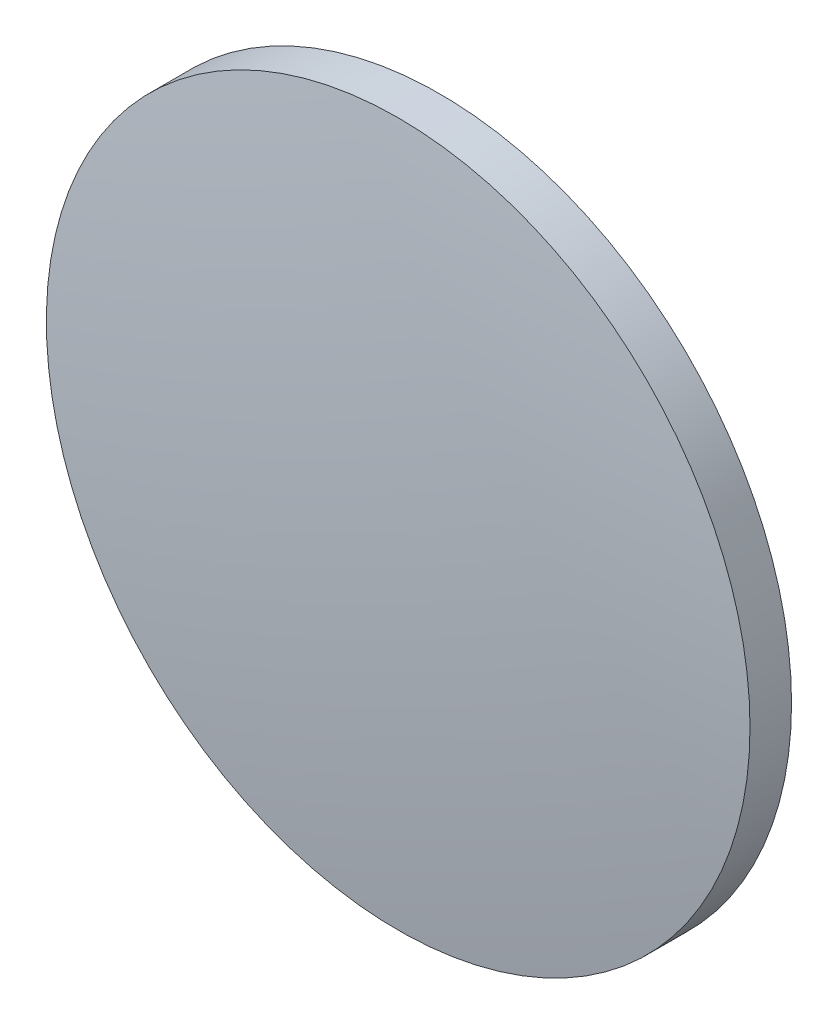
ISO-10303-21;
HEADER;
FILE_DESCRIPTION(('STEP AP214'),'2;1');
FILE_NAME('part.step','',(''),(''),'','','');
FILE_SCHEMA(('AUTOMOTIVE_DESIGN { 1 0 10303 214 1 1 1 1 }'));
ENDSEC;
DATA;
#1=APPLICATION_CONTEXT('core data for automotive mechanical design processes');
#2=APPLICATION_PROTOCOL_DEFINITION('international standard','automotive_design',2000,#1);
#3=PRODUCT_CONTEXT('',#1,'mechanical');
#4=PRODUCT('Part','Part','',(#3));
#5=PRODUCT_RELATED_PRODUCT_CATEGORY('part','',(#4));
#6=PRODUCT_DEFINITION_FORMATION('','',#4);
#7=PRODUCT_DEFINITION_CONTEXT('part definition',#1,'design');
#8=PRODUCT_DEFINITION('design','',#6,#7);
#9=PRODUCT_DEFINITION_SHAPE('','',#8);
#10=(LENGTH_UNIT() NAMED_UNIT(*) SI_UNIT(.MILLI.,.METRE.));
#11=(NAMED_UNIT(*) PLANE_ANGLE_UNIT() SI_UNIT($,.RADIAN.));
#12=(NAMED_UNIT(*) SI_UNIT($,.STERADIAN.) SOLID_ANGLE_UNIT());
#13=UNCERTAINTY_MEASURE_WITH_UNIT(LENGTH_MEASURE(1.E-05),#10,'distance_accuracy_value','');
#14=(GEOMETRIC_REPRESENTATION_CONTEXT(3) GLOBAL_UNCERTAINTY_ASSIGNED_CONTEXT((#13)) GLOBAL_UNIT_ASSIGNED_CONTEXT((#10,
#11,#12)) REPRESENTATION_CONTEXT('',''));
#15=CARTESIAN_POINT('',(0.,0.,0.));
#16=DIRECTION('',(0.,0.,1.));
#17=DIRECTION('',(1.,0.,0.));
#18=AXIS2_PLACEMENT_3D('',#15,#16,#17);
#19=CARTESIAN_POINT('',(0.,0.,-203.745));
#20=DIRECTION('',(0.,0.,1.));
#21=DIRECTION('',(0.,1.,0.));
#22=AXIS2_PLACEMENT_3D('',#19,#20,#21);
#23=SPHERICAL_SURFACE('',#22,206.03);
#24=CARTESIAN_POINT('',(0.,0.,0.713310909583743));
#25=DIRECTION('',(0.,0.,1.));
#26=DIRECTION('',(1.,0.,0.));
#27=AXIS2_PLACEMENT_3D('',#24,#25,#26);
#28=CIRCLE('',#27,25.4);
#29=CARTESIAN_POINT('',(25.4,0.,0.713310909583743));
#30=VERTEX_POINT('',#29);
#31=EDGE_CURVE('E8',#30,#30,#28,.T.);
#32=ORIENTED_EDGE('',*,*,#31,.T.);
#33=EDGE_LOOP('',(#32));
#34=FACE_BOUND('',#33,.T.);
#35=ADVANCED_FACE('F12',(#34),#23,.T.);
#36=CARTESIAN_POINT('',(0.,0.,4.30813204540037));
#37=DIRECTION('',(0.,0.,1.));
#38=DIRECTION('',(1.,0.,0.));
#39=AXIS2_PLACEMENT_3D('',#36,#37,#38);
#40=CYLINDRICAL_SURFACE('',#39,25.4);
#41=ORIENTED_EDGE('',*,*,#31,.F.);
#42=EDGE_LOOP('',(#41));
#43=FACE_BOUND('',#42,.T.);
#44=CARTESIAN_POINT('',(0.,0.,-2.285));
#45=DIRECTION('',(0.,0.,1.));
#46=DIRECTION('',(1.,0.,0.));
#47=AXIS2_PLACEMENT_3D('',#44,#45,#46);
#48=CIRCLE('',#47,25.4);
#49=CARTESIAN_POINT('',(25.4,0.,-2.285));
#50=VERTEX_POINT('',#49);
#51=EDGE_CURVE('E18',#50,#50,#48,.T.);
#52=ORIENTED_EDGE('',*,*,#51,.T.);
#53=EDGE_LOOP('',(#52));
#54=FACE_BOUND('',#53,.T.);
#55=ADVANCED_FACE('F24',(#43,#54),#40,.T.);
#56=CARTESIAN_POINT('',(0.,0.,-2.285));
#57=DIRECTION('',(0.,0.,1.));
#58=DIRECTION('',(1.,0.,0.));
#59=AXIS2_PLACEMENT_3D('',#56,#57,#58);
#60=PLANE('',#59);
#61=ORIENTED_EDGE('',*,*,#51,.F.);
#62=EDGE_LOOP('',(#61));
#63=FACE_BOUND('',#62,.T.);
#64=ADVANCED_FACE('F26',(#63),#60,.F.);
#65=CLOSED_SHELL('',(#35,#55,#64));
#66=MANIFOLD_SOLID_BREP('B1',#65);
#67=ADVANCED_BREP_SHAPE_REPRESENTATION('',(#18,#66),#14);
#68=SHAPE_DEFINITION_REPRESENTATION(#9,#67);
ENDSEC;
END-ISO-10303-21;
